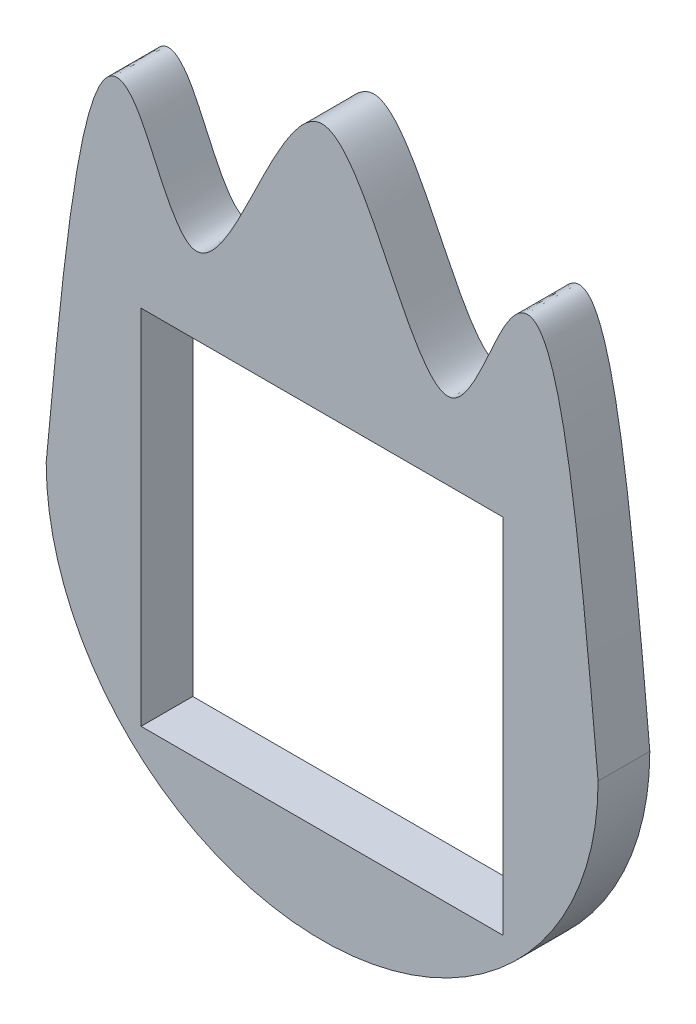
ISO-10303-21;
HEADER;
FILE_DESCRIPTION(('STEP AP214'),'2;1');
FILE_NAME('part.step','',(''),(''),'','','');
FILE_SCHEMA(('AUTOMOTIVE_DESIGN { 1 0 10303 214 1 1 1 1 }'));
ENDSEC;
DATA;
#1=APPLICATION_CONTEXT('core data for automotive mechanical design processes');
#2=APPLICATION_PROTOCOL_DEFINITION('international standard','automotive_design',2000,#1);
#3=PRODUCT_CONTEXT('',#1,'mechanical');
#4=PRODUCT('Part','Part','',(#3));
#5=PRODUCT_RELATED_PRODUCT_CATEGORY('part','',(#4));
#6=PRODUCT_DEFINITION_FORMATION('','',#4);
#7=PRODUCT_DEFINITION_CONTEXT('part definition',#1,'design');
#8=PRODUCT_DEFINITION('design','',#6,#7);
#9=PRODUCT_DEFINITION_SHAPE('','',#8);
#10=(LENGTH_UNIT() NAMED_UNIT(*) SI_UNIT(.MILLI.,.METRE.));
#11=(NAMED_UNIT(*) PLANE_ANGLE_UNIT() SI_UNIT($,.RADIAN.));
#12=(NAMED_UNIT(*) SI_UNIT($,.STERADIAN.) SOLID_ANGLE_UNIT());
#13=UNCERTAINTY_MEASURE_WITH_UNIT(LENGTH_MEASURE(1.E-05),#10,'distance_accuracy_value','');
#14=(GEOMETRIC_REPRESENTATION_CONTEXT(3) GLOBAL_UNCERTAINTY_ASSIGNED_CONTEXT((#13)) GLOBAL_UNIT_ASSIGNED_CONTEXT((#10,
#11,#12)) REPRESENTATION_CONTEXT('',''));
#15=CARTESIAN_POINT('',(0.,0.,0.));
#16=DIRECTION('',(0.,0.,1.));
#17=DIRECTION('',(1.,0.,0.));
#18=AXIS2_PLACEMENT_3D('',#15,#16,#17);
#19=CARTESIAN_POINT('',(14.0162311286204,39.9246110584726,6.));
#20=CARTESIAN_POINT('',(16.420544726679,65.6132329725537,6.));
#21=CARTESIAN_POINT('',(19.5007391593559,98.5232286847545,6.));
#22=CARTESIAN_POINT('',(30.9827580597676,64.0312569207285,6.));
#23=CARTESIAN_POINT('',(38.5679490254606,80.2860225834443,6.));
#24=CARTESIAN_POINT('',(46.0162311286204,94.7439052959867,6.));
#25=CARTESIAN_POINT('',(53.4645132317802,80.2860225834442,6.));
#26=CARTESIAN_POINT('',(61.0497041974731,64.0312569207285,6.));
#27=CARTESIAN_POINT('',(72.5317230978849,98.5232286847545,6.));
#28=CARTESIAN_POINT('',(75.6119175305618,65.6132329725537,6.));
#29=CARTESIAN_POINT('',(78.0162311286204,39.9246110584726,6.));
#30=B_SPLINE_CURVE_WITH_KNOTS('',3,(#19,#20,#21,#22,#23,#24,#25,#26,#27,#28,#29),.UNSPECIFIED.,
.F.,.F.,(4,1,1,1,1,1,1,1,4),(0.,0.265429392875605,0.340044717487941,0.420022358743971,0.5,
0.579977641256029,0.659955282512059,0.734570607124395,1.),.UNSPECIFIED.);
#31=DIRECTION('',(0.,0.,-1.));
#32=VECTOR('',#31,1.);
#33=SURFACE_OF_LINEAR_EXTRUSION('',#30,#32);
#34=CARTESIAN_POINT('',(14.0162311286204,39.9246110584726,0.));
#35=CARTESIAN_POINT('',(16.420544726679,65.6132329725537,0.));
#36=CARTESIAN_POINT('',(19.5007391593559,98.5232286847545,0.));
#37=CARTESIAN_POINT('',(30.9827580597676,64.0312569207285,0.));
#38=CARTESIAN_POINT('',(38.5679490254606,80.2860225834443,0.));
#39=CARTESIAN_POINT('',(46.0162311286204,94.7439052959867,0.));
#40=CARTESIAN_POINT('',(53.4645132317802,80.2860225834442,0.));
#41=CARTESIAN_POINT('',(61.0497041974731,64.0312569207285,0.));
#42=CARTESIAN_POINT('',(72.5317230978849,98.5232286847545,0.));
#43=CARTESIAN_POINT('',(75.6119175305618,65.6132329725537,0.));
#44=CARTESIAN_POINT('',(78.0162311286204,39.9246110584726,0.));
#45=B_SPLINE_CURVE_WITH_KNOTS('',3,(#34,#35,#36,#37,#38,#39,#40,#41,#42,#43,#44),.UNSPECIFIED.,
.F.,.F.,(4,1,1,1,1,1,1,1,4),(0.,0.265429392875605,0.340044717487941,0.420022358743971,0.5,
0.579977641256029,0.659955282512059,0.734570607124395,1.),.UNSPECIFIED.);
#46=CARTESIAN_POINT('',(14.0162311286204,39.9246110584726,0.));
#47=VERTEX_POINT('',#46);
#48=CARTESIAN_POINT('',(78.0162311286204,39.9246110584726,0.));
#49=VERTEX_POINT('',#48);
#50=EDGE_CURVE('E123',#47,#49,#45,.T.);
#51=ORIENTED_EDGE('',*,*,#50,.F.);
#52=DIRECTION('',(0.,0.,-1.));
#53=VECTOR('',#52,1.);
#54=CARTESIAN_POINT('',(14.0162311286204,39.9246110584726,6.));
#55=LINE('',#54,#53);
#56=CARTESIAN_POINT('',(14.0162311286204,39.9246110584726,6.));
#57=VERTEX_POINT('',#56);
#58=EDGE_CURVE('E12',#57,#47,#55,.T.);
#59=ORIENTED_EDGE('',*,*,#58,.F.);
#60=CARTESIAN_POINT('',(78.0162311286204,39.9246110584726,6.));
#61=VERTEX_POINT('',#60);
#62=EDGE_CURVE('E163',#57,#61,#30,.T.);
#63=ORIENTED_EDGE('',*,*,#62,.T.);
#64=DIRECTION('',(0.,0.,-1.));
#65=VECTOR('',#64,1.);
#66=CARTESIAN_POINT('',(78.0162311286204,39.9246110584726,6.));
#67=LINE('',#66,#65);
#68=EDGE_CURVE('E66',#61,#49,#67,.T.);
#69=ORIENTED_EDGE('',*,*,#68,.T.);
#70=EDGE_LOOP('',(#51,#59,#63,#69));
#71=FACE_BOUND('',#70,.T.);
#72=ADVANCED_FACE('F62',(#71),#33,.T.);
#73=CARTESIAN_POINT('',(46.0162311286204,39.9246110584726,6.));
#74=DIRECTION('',(0.,0.,-1.));
#75=DIRECTION('',(-1.,0.,0.));
#76=AXIS2_PLACEMENT_3D('',#73,#74,#75);
#77=CYLINDRICAL_SURFACE('',#76,32.);
#78=CARTESIAN_POINT('',(46.0162311286204,39.9246110584726,0.));
#79=DIRECTION('',(0.,0.,1.));
#80=DIRECTION('',(1.,0.,0.));
#81=AXIS2_PLACEMENT_3D('',#78,#79,#80);
#82=CIRCLE('',#81,32.);
#83=EDGE_CURVE('E171',#47,#49,#82,.T.);
#84=ORIENTED_EDGE('',*,*,#83,.T.);
#85=ORIENTED_EDGE('',*,*,#68,.F.);
#86=CARTESIAN_POINT('',(46.0162311286204,39.9246110584726,6.));
#87=DIRECTION('',(0.,0.,1.));
#88=DIRECTION('',(1.,0.,0.));
#89=AXIS2_PLACEMENT_3D('',#86,#87,#88);
#90=CIRCLE('',#89,32.);
#91=EDGE_CURVE('E170',#57,#61,#90,.T.);
#92=ORIENTED_EDGE('',*,*,#91,.F.);
#93=ORIENTED_EDGE('',*,*,#58,.T.);
#94=EDGE_LOOP('',(#84,#85,#92,#93));
#95=FACE_BOUND('',#94,.T.);
#96=ADVANCED_FACE('F190',(#95),#77,.T.);
#97=CARTESIAN_POINT('',(46.0162311286204,89.9246110584726,6.));
#98=DIRECTION('',(0.,0.,1.));
#99=DIRECTION('',(1.,0.,0.));
#100=AXIS2_PLACEMENT_3D('',#97,#98,#99);
#101=PLANE('',#100);
#102=DIRECTION('',(0.,1.,0.));
#103=VECTOR('',#102,1.);
#104=CARTESIAN_POINT('',(25.0162311286204,0.,6.));
#105=LINE('',#104,#103);
#106=CARTESIAN_POINT('',(25.0162311286204,18.9246110584726,6.));
#107=VERTEX_POINT('',#106);
#108=CARTESIAN_POINT('',(25.0162311286204,60.9246110584726,6.));
#109=VERTEX_POINT('',#108);
#110=EDGE_CURVE('E127',#107,#109,#105,.T.);
#111=ORIENTED_EDGE('',*,*,#110,.T.);
#112=DIRECTION('',(1.,0.,0.));
#113=VECTOR('',#112,1.);
#114=CARTESIAN_POINT('',(0.,60.9246110584726,6.));
#115=LINE('',#114,#113);
#116=CARTESIAN_POINT('',(67.0162311286204,60.9246110584726,6.));
#117=VERTEX_POINT('',#116);
#118=EDGE_CURVE('E141',#109,#117,#115,.T.);
#119=ORIENTED_EDGE('',*,*,#118,.T.);
#120=DIRECTION('',(0.,-1.,0.));
#121=VECTOR('',#120,1.);
#122=CARTESIAN_POINT('',(67.0162311286204,0.,6.));
#123=LINE('',#122,#121);
#124=CARTESIAN_POINT('',(67.0162311286204,18.9246110584726,6.));
#125=VERTEX_POINT('',#124);
#126=EDGE_CURVE('E78',#117,#125,#123,.T.);
#127=ORIENTED_EDGE('',*,*,#126,.T.);
#128=DIRECTION('',(-1.,0.,0.));
#129=VECTOR('',#128,1.);
#130=CARTESIAN_POINT('',(0.,18.9246110584726,6.));
#131=LINE('',#130,#129);
#132=EDGE_CURVE('E119',#125,#107,#131,.T.);
#133=ORIENTED_EDGE('',*,*,#132,.T.);
#134=EDGE_LOOP('',(#111,#119,#127,#133));
#135=FACE_BOUND('',#134,.T.);
#136=ORIENTED_EDGE('',*,*,#62,.F.);
#137=ORIENTED_EDGE('',*,*,#91,.T.);
#138=EDGE_LOOP('',(#136,#137));
#139=FACE_BOUND('',#138,.T.);
#140=ADVANCED_FACE('F136',(#135,#139),#101,.T.);
#141=CARTESIAN_POINT('',(46.0162311286204,89.9246110584726,0.));
#142=DIRECTION('',(0.,0.,1.));
#143=DIRECTION('',(1.,0.,0.));
#144=AXIS2_PLACEMENT_3D('',#141,#142,#143);
#145=PLANE('',#144);
#146=DIRECTION('',(1.,0.,0.));
#147=VECTOR('',#146,1.);
#148=CARTESIAN_POINT('',(0.,60.9246110584726,0.));
#149=LINE('',#148,#147);
#150=CARTESIAN_POINT('',(25.0162311286204,60.9246110584726,0.));
#151=VERTEX_POINT('',#150);
#152=CARTESIAN_POINT('',(67.0162311286204,60.9246110584726,0.));
#153=VERTEX_POINT('',#152);
#154=EDGE_CURVE('E134',#151,#153,#149,.T.);
#155=ORIENTED_EDGE('',*,*,#154,.F.);
#156=DIRECTION('',(0.,1.,0.));
#157=VECTOR('',#156,1.);
#158=CARTESIAN_POINT('',(25.0162311286204,0.,0.));
#159=LINE('',#158,#157);
#160=CARTESIAN_POINT('',(25.0162311286204,18.9246110584726,0.));
#161=VERTEX_POINT('',#160);
#162=EDGE_CURVE('E86',#161,#151,#159,.T.);
#163=ORIENTED_EDGE('',*,*,#162,.F.);
#164=DIRECTION('',(-1.,0.,0.));
#165=VECTOR('',#164,1.);
#166=CARTESIAN_POINT('',(0.,18.9246110584726,0.));
#167=LINE('',#166,#165);
#168=CARTESIAN_POINT('',(67.0162311286204,18.9246110584726,0.));
#169=VERTEX_POINT('',#168);
#170=EDGE_CURVE('E121',#169,#161,#167,.T.);
#171=ORIENTED_EDGE('',*,*,#170,.F.);
#172=DIRECTION('',(0.,-1.,0.));
#173=VECTOR('',#172,1.);
#174=CARTESIAN_POINT('',(67.0162311286204,0.,0.));
#175=LINE('',#174,#173);
#176=EDGE_CURVE('E150',#153,#169,#175,.T.);
#177=ORIENTED_EDGE('',*,*,#176,.F.);
#178=EDGE_LOOP('',(#155,#163,#171,#177));
#179=FACE_BOUND('',#178,.T.);
#180=ORIENTED_EDGE('',*,*,#50,.T.);
#181=ORIENTED_EDGE('',*,*,#83,.F.);
#182=EDGE_LOOP('',(#180,#181));
#183=FACE_BOUND('',#182,.T.);
#184=ADVANCED_FACE('F194',(#179,#183),#145,.F.);
#185=CARTESIAN_POINT('',(25.0162311286204,0.,6.));
#186=DIRECTION('',(-1.,0.,0.));
#187=DIRECTION('',(0.,0.,1.));
#188=AXIS2_PLACEMENT_3D('',#185,#186,#187);
#189=PLANE('',#188);
#190=ORIENTED_EDGE('',*,*,#162,.T.);
#191=DIRECTION('',(0.,0.,-1.));
#192=VECTOR('',#191,1.);
#193=CARTESIAN_POINT('',(25.0162311286204,60.9246110584726,6.));
#194=LINE('',#193,#192);
#195=EDGE_CURVE('E129',#109,#151,#194,.T.);
#196=ORIENTED_EDGE('',*,*,#195,.F.);
#197=ORIENTED_EDGE('',*,*,#110,.F.);
#198=DIRECTION('',(0.,0.,-1.));
#199=VECTOR('',#198,1.);
#200=CARTESIAN_POINT('',(25.0162311286204,18.9246110584726,6.));
#201=LINE('',#200,#199);
#202=EDGE_CURVE('E115',#107,#161,#201,.T.);
#203=ORIENTED_EDGE('',*,*,#202,.T.);
#204=EDGE_LOOP('',(#190,#196,#197,#203));
#205=FACE_BOUND('',#204,.T.);
#206=ADVANCED_FACE('F128',(#205),#189,.F.);
#207=CARTESIAN_POINT('',(0.,18.9246110584726,6.));
#208=DIRECTION('',(0.,-1.,0.));
#209=DIRECTION('',(0.,0.,-1.));
#210=AXIS2_PLACEMENT_3D('',#207,#208,#209);
#211=PLANE('',#210);
#212=ORIENTED_EDGE('',*,*,#170,.T.);
#213=ORIENTED_EDGE('',*,*,#202,.F.);
#214=ORIENTED_EDGE('',*,*,#132,.F.);
#215=DIRECTION('',(0.,0.,-1.));
#216=VECTOR('',#215,1.);
#217=CARTESIAN_POINT('',(67.0162311286204,18.9246110584726,6.));
#218=LINE('',#217,#216);
#219=EDGE_CURVE('E124',#125,#169,#218,.T.);
#220=ORIENTED_EDGE('',*,*,#219,.T.);
#221=EDGE_LOOP('',(#212,#213,#214,#220));
#222=FACE_BOUND('',#221,.T.);
#223=ADVANCED_FACE('F117',(#222),#211,.F.);
#224=CARTESIAN_POINT('',(67.0162311286204,0.,6.));
#225=DIRECTION('',(1.,0.,0.));
#226=DIRECTION('',(0.,0.,-1.));
#227=AXIS2_PLACEMENT_3D('',#224,#225,#226);
#228=PLANE('',#227);
#229=ORIENTED_EDGE('',*,*,#176,.T.);
#230=ORIENTED_EDGE('',*,*,#219,.F.);
#231=ORIENTED_EDGE('',*,*,#126,.F.);
#232=DIRECTION('',(0.,0.,-1.));
#233=VECTOR('',#232,1.);
#234=CARTESIAN_POINT('',(67.0162311286204,60.9246110584726,6.));
#235=LINE('',#234,#233);
#236=EDGE_CURVE('E159',#117,#153,#235,.T.);
#237=ORIENTED_EDGE('',*,*,#236,.T.);
#238=EDGE_LOOP('',(#229,#230,#231,#237));
#239=FACE_BOUND('',#238,.T.);
#240=ADVANCED_FACE('F240',(#239),#228,.F.);
#241=CARTESIAN_POINT('',(0.,60.9246110584726,6.));
#242=DIRECTION('',(0.,1.,0.));
#243=DIRECTION('',(0.,0.,1.));
#244=AXIS2_PLACEMENT_3D('',#241,#242,#243);
#245=PLANE('',#244);
#246=ORIENTED_EDGE('',*,*,#154,.T.);
#247=ORIENTED_EDGE('',*,*,#236,.F.);
#248=ORIENTED_EDGE('',*,*,#118,.F.);
#249=ORIENTED_EDGE('',*,*,#195,.T.);
#250=EDGE_LOOP('',(#246,#247,#248,#249));
#251=FACE_BOUND('',#250,.T.);
#252=ADVANCED_FACE('F249',(#251),#245,.F.);
#253=CLOSED_SHELL('',(#72,#96,#140,#184,#206,#223,#240,#252));
#254=MANIFOLD_SOLID_BREP('B2',#253);
#255=ADVANCED_BREP_SHAPE_REPRESENTATION('',(#18,#254),#14);
#256=SHAPE_DEFINITION_REPRESENTATION(#9,#255);
ENDSEC;
END-ISO-10303-21;
